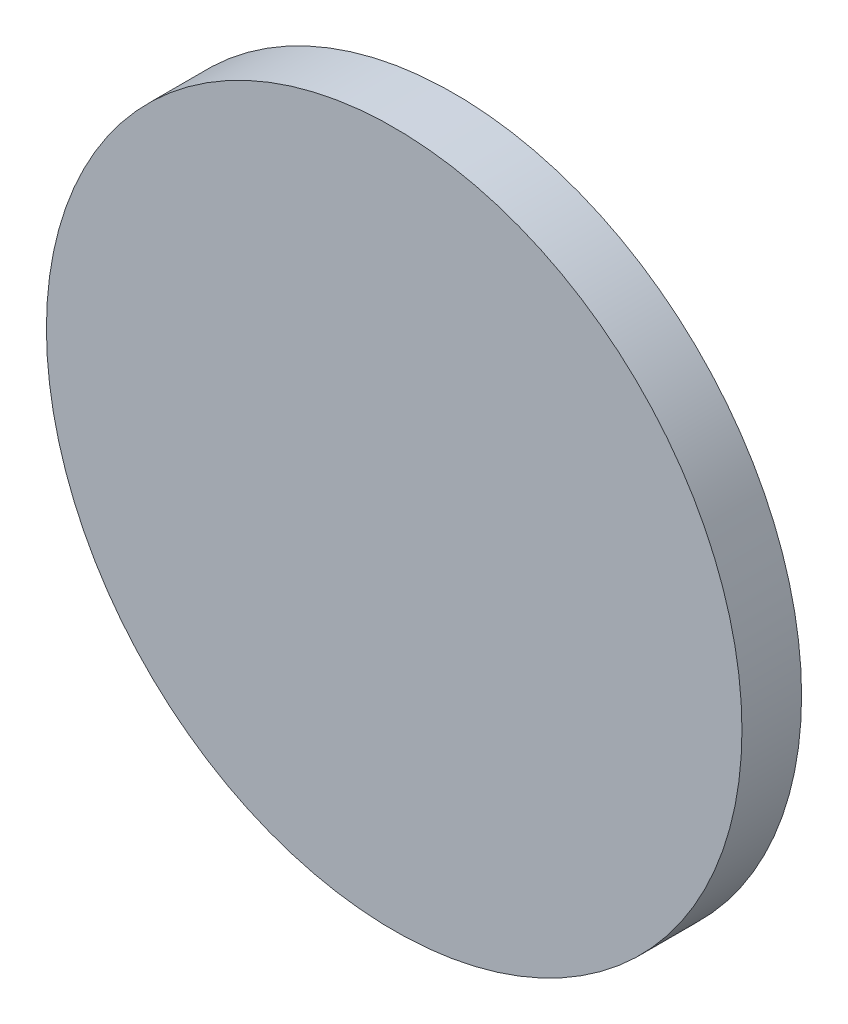
ISO-10303-21;
HEADER;
FILE_DESCRIPTION(('STEP AP214'),'2;1');
FILE_NAME('part.step','',(''),(''),'','','');
FILE_SCHEMA(('AUTOMOTIVE_DESIGN { 1 0 10303 214 1 1 1 1 }'));
ENDSEC;
DATA;
#1=APPLICATION_CONTEXT('core data for automotive mechanical design processes');
#2=APPLICATION_PROTOCOL_DEFINITION('international standard','automotive_design',2000,#1);
#3=PRODUCT_CONTEXT('',#1,'mechanical');
#4=PRODUCT('Part','Part','',(#3));
#5=PRODUCT_RELATED_PRODUCT_CATEGORY('part','',(#4));
#6=PRODUCT_DEFINITION_FORMATION('','',#4);
#7=PRODUCT_DEFINITION_CONTEXT('part definition',#1,'design');
#8=PRODUCT_DEFINITION('design','',#6,#7);
#9=PRODUCT_DEFINITION_SHAPE('','',#8);
#10=(LENGTH_UNIT() NAMED_UNIT(*) SI_UNIT(.MILLI.,.METRE.));
#11=(NAMED_UNIT(*) PLANE_ANGLE_UNIT() SI_UNIT($,.RADIAN.));
#12=(NAMED_UNIT(*) SI_UNIT($,.STERADIAN.) SOLID_ANGLE_UNIT());
#13=UNCERTAINTY_MEASURE_WITH_UNIT(LENGTH_MEASURE(1.E-05),#10,'distance_accuracy_value','');
#14=(GEOMETRIC_REPRESENTATION_CONTEXT(3) GLOBAL_UNCERTAINTY_ASSIGNED_CONTEXT((#13)) GLOBAL_UNIT_ASSIGNED_CONTEXT((#10,
#11,#12)) REPRESENTATION_CONTEXT('',''));
#15=CARTESIAN_POINT('',(0.,0.,0.));
#16=DIRECTION('',(0.,0.,1.));
#17=DIRECTION('',(1.,0.,0.));
#18=AXIS2_PLACEMENT_3D('',#15,#16,#17);
#19=CARTESIAN_POINT('',(1.72974,1.978660006176,0.03429));
#20=DIRECTION('',(0.,0.,1.));
#21=DIRECTION('',(1.,0.,0.));
#22=AXIS2_PLACEMENT_3D('',#19,#20,#21);
#23=PLANE('',#22);
#24=CARTESIAN_POINT('',(1.72974,1.978660006176,0.03429));
#25=DIRECTION('',(0.,0.,1.));
#26=DIRECTION('',(1.,0.,0.));
#27=AXIS2_PLACEMENT_3D('',#24,#25,#26);
#28=CIRCLE('',#27,0.200024667);
#29=CARTESIAN_POINT('',(1.929764667,1.978660006176,0.03429));
#30=VERTEX_POINT('',#29);
#31=EDGE_CURVE('E18',#30,#30,#28,.F.);
#32=ORIENTED_EDGE('',*,*,#31,.F.);
#33=EDGE_LOOP('',(#32));
#34=FACE_BOUND('',#33,.T.);
#35=ADVANCED_FACE('F15',(#34),#23,.T.);
#36=CARTESIAN_POINT('',(1.72974,1.978660006176,0.));
#37=DIRECTION('',(0.,0.,1.));
#38=DIRECTION('',(1.,0.,0.));
#39=AXIS2_PLACEMENT_3D('',#36,#37,#38);
#40=CYLINDRICAL_SURFACE('',#39,0.200024667);
#41=ORIENTED_EDGE('',*,*,#31,.T.);
#42=EDGE_LOOP('',(#41));
#43=FACE_BOUND('',#42,.T.);
#44=CARTESIAN_POINT('',(1.72974,1.978660006176,0.));
#45=DIRECTION('',(0.,0.,1.));
#46=DIRECTION('',(1.,0.,0.));
#47=AXIS2_PLACEMENT_3D('',#44,#45,#46);
#48=CIRCLE('',#47,0.200024667);
#49=CARTESIAN_POINT('',(1.929764667,1.978660006176,0.));
#50=VERTEX_POINT('',#49);
#51=EDGE_CURVE('E10',#50,#50,#48,.F.);
#52=ORIENTED_EDGE('',*,*,#51,.F.);
#53=EDGE_LOOP('',(#52));
#54=FACE_BOUND('',#53,.T.);
#55=ADVANCED_FACE('F27',(#43,#54),#40,.T.);
#56=CARTESIAN_POINT('',(1.72974,1.978660006176,0.));
#57=DIRECTION('',(0.,0.,-1.));
#58=DIRECTION('',(-1.,0.,0.));
#59=AXIS2_PLACEMENT_3D('',#56,#57,#58);
#60=PLANE('',#59);
#61=ORIENTED_EDGE('',*,*,#51,.T.);
#62=EDGE_LOOP('',(#61));
#63=FACE_BOUND('',#62,.T.);
#64=ADVANCED_FACE('F35',(#63),#60,.T.);
#65=CLOSED_SHELL('',(#35,#55,#64));
#66=MANIFOLD_SOLID_BREP('B1',#65);
#67=ADVANCED_BREP_SHAPE_REPRESENTATION('',(#18,#66),#14);
#68=SHAPE_DEFINITION_REPRESENTATION(#9,#67);
ENDSEC;
END-ISO-10303-21;
